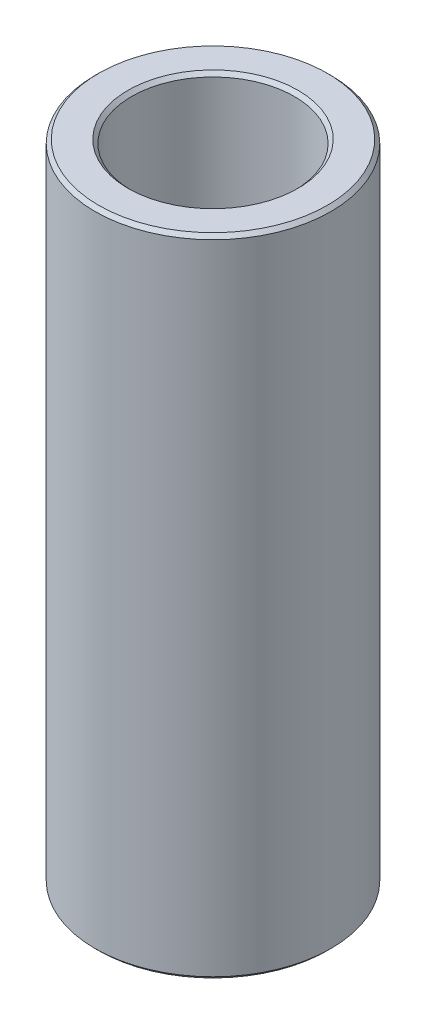
ISO-10303-21;
HEADER;
FILE_DESCRIPTION(('STEP AP214'),'2;1');
FILE_NAME('part.step','',(''),(''),'','','');
FILE_SCHEMA(('AUTOMOTIVE_DESIGN { 1 0 10303 214 1 1 1 1 }'));
ENDSEC;
DATA;
#1=APPLICATION_CONTEXT('core data for automotive mechanical design processes');
#2=APPLICATION_PROTOCOL_DEFINITION('international standard','automotive_design',2000,#1);
#3=PRODUCT_CONTEXT('',#1,'mechanical');
#4=PRODUCT('Part','Part','',(#3));
#5=PRODUCT_RELATED_PRODUCT_CATEGORY('part','',(#4));
#6=PRODUCT_DEFINITION_FORMATION('','',#4);
#7=PRODUCT_DEFINITION_CONTEXT('part definition',#1,'design');
#8=PRODUCT_DEFINITION('design','',#6,#7);
#9=PRODUCT_DEFINITION_SHAPE('','',#8);
#10=(LENGTH_UNIT() NAMED_UNIT(*) SI_UNIT(.MILLI.,.METRE.));
#11=(NAMED_UNIT(*) PLANE_ANGLE_UNIT() SI_UNIT($,.RADIAN.));
#12=(NAMED_UNIT(*) SI_UNIT($,.STERADIAN.) SOLID_ANGLE_UNIT());
#13=UNCERTAINTY_MEASURE_WITH_UNIT(LENGTH_MEASURE(1.E-05),#10,'distance_accuracy_value','');
#14=(GEOMETRIC_REPRESENTATION_CONTEXT(3) GLOBAL_UNCERTAINTY_ASSIGNED_CONTEXT((#13)) GLOBAL_UNIT_ASSIGNED_CONTEXT((#10,
#11,#12)) REPRESENTATION_CONTEXT('',''));
#15=CARTESIAN_POINT('',(0.,0.,0.));
#16=DIRECTION('',(0.,0.,1.));
#17=DIRECTION('',(1.,0.,0.));
#18=AXIS2_PLACEMENT_3D('',#15,#16,#17);
#19=CARTESIAN_POINT('',(0.,300.995779483035,0.));
#20=DIRECTION('',(0.,-1.,0.));
#21=DIRECTION('',(0.,0.,-1.));
#22=AXIS2_PLACEMENT_3D('',#19,#20,#21);
#23=CYLINDRICAL_SURFACE('',#22,55.);
#24=CARTESIAN_POINT('',(0.,1.67099441765101,0.));
#25=DIRECTION('',(0.,1.,0.));
#26=DIRECTION('',(0.,0.,1.));
#27=AXIS2_PLACEMENT_3D('',#24,#25,#26);
#28=CIRCLE('',#27,55.);
#29=CARTESIAN_POINT('',(0.,1.67099441765101,55.));
#30=VERTEX_POINT('',#29);
#31=EDGE_CURVE('E10',#30,#30,#28,.T.);
#32=ORIENTED_EDGE('',*,*,#31,.T.);
#33=EDGE_LOOP('',(#32));
#34=FACE_BOUND('',#33,.T.);
#35=CARTESIAN_POINT('',(0.,299.324785065384,0.));
#36=DIRECTION('',(0.,1.,0.));
#37=DIRECTION('',(0.,0.,1.));
#38=AXIS2_PLACEMENT_3D('',#35,#36,#37);
#39=CIRCLE('',#38,55.);
#40=CARTESIAN_POINT('',(0.,299.324785065384,55.));
#41=VERTEX_POINT('',#40);
#42=EDGE_CURVE('E50',#41,#41,#39,.F.);
#43=ORIENTED_EDGE('',*,*,#42,.T.);
#44=EDGE_LOOP('',(#43));
#45=FACE_BOUND('',#44,.T.);
#46=ADVANCED_FACE('F39',(#34,#45),#23,.T.);
#47=CARTESIAN_POINT('',(0.,300.995779483035,0.));
#48=DIRECTION('',(0.,1.,0.));
#49=DIRECTION('',(0.,0.,1.));
#50=AXIS2_PLACEMENT_3D('',#47,#48,#49);
#51=PLANE('',#50);
#52=CARTESIAN_POINT('',(0.,300.995779483035,0.));
#53=DIRECTION('',(0.,1.,0.));
#54=DIRECTION('',(0.,0.,1.));
#55=AXIS2_PLACEMENT_3D('',#52,#53,#54);
#56=CIRCLE('',#55,39.6455620120512);
#57=CARTESIAN_POINT('',(0.,300.995779483035,39.6455620120512));
#58=VERTEX_POINT('',#57);
#59=EDGE_CURVE('E58',#58,#58,#56,.F.);
#60=ORIENTED_EDGE('',*,*,#59,.T.);
#61=EDGE_LOOP('',(#60));
#62=FACE_BOUND('',#61,.T.);
#63=CARTESIAN_POINT('',(0.,300.995779483035,0.));
#64=DIRECTION('',(0.,1.,0.));
#65=DIRECTION('',(0.,0.,1.));
#66=AXIS2_PLACEMENT_3D('',#63,#64,#65);
#67=CIRCLE('',#66,53.3290055823489);
#68=CARTESIAN_POINT('',(0.,300.995779483035,53.3290055823489));
#69=VERTEX_POINT('',#68);
#70=EDGE_CURVE('E61',#69,#69,#67,.T.);
#71=ORIENTED_EDGE('',*,*,#70,.T.);
#72=EDGE_LOOP('',(#71));
#73=FACE_BOUND('',#72,.T.);
#74=ADVANCED_FACE('F88',(#62,#73),#51,.T.);
#75=CARTESIAN_POINT('',(0.,0.,0.));
#76=DIRECTION('',(0.,1.,0.));
#77=DIRECTION('',(0.,0.,1.));
#78=AXIS2_PLACEMENT_3D('',#75,#76,#77);
#79=PLANE('',#78);
#80=CARTESIAN_POINT('',(0.,0.,0.));
#81=DIRECTION('',(0.,1.,0.));
#82=DIRECTION('',(0.,0.,1.));
#83=AXIS2_PLACEMENT_3D('',#80,#81,#82);
#84=CIRCLE('',#83,39.6455620120512);
#85=CARTESIAN_POINT('',(0.,0.,39.6455620120512));
#86=VERTEX_POINT('',#85);
#87=EDGE_CURVE('E51',#86,#86,#84,.T.);
#88=ORIENTED_EDGE('',*,*,#87,.T.);
#89=EDGE_LOOP('',(#88));
#90=FACE_BOUND('',#89,.T.);
#91=CARTESIAN_POINT('',(0.,0.,0.));
#92=DIRECTION('',(0.,1.,0.));
#93=DIRECTION('',(0.,0.,1.));
#94=AXIS2_PLACEMENT_3D('',#91,#92,#93);
#95=CIRCLE('',#94,53.329005582349);
#96=CARTESIAN_POINT('',(0.,0.,53.329005582349));
#97=VERTEX_POINT('',#96);
#98=EDGE_CURVE('E54',#97,#97,#95,.F.);
#99=ORIENTED_EDGE('',*,*,#98,.T.);
#100=EDGE_LOOP('',(#99));
#101=FACE_BOUND('',#100,.T.);
#102=ADVANCED_FACE('F83',(#90,#101),#79,.F.);
#103=CARTESIAN_POINT('',(0.,300.995779483035,0.));
#104=DIRECTION('',(0.,-1.,0.));
#105=DIRECTION('',(0.,0.,-1.));
#106=AXIS2_PLACEMENT_3D('',#103,#104,#105);
#107=CYLINDRICAL_SURFACE('',#106,37.9745675944001);
#108=CARTESIAN_POINT('',(0.,299.324785065384,0.));
#109=DIRECTION('',(0.,1.,0.));
#110=DIRECTION('',(0.,0.,1.));
#111=AXIS2_PLACEMENT_3D('',#108,#109,#110);
#112=CIRCLE('',#111,37.9745675944001);
#113=CARTESIAN_POINT('',(0.,299.324785065384,37.9745675944001));
#114=VERTEX_POINT('',#113);
#115=EDGE_CURVE('E67',#114,#114,#112,.T.);
#116=ORIENTED_EDGE('',*,*,#115,.T.);
#117=EDGE_LOOP('',(#116));
#118=FACE_BOUND('',#117,.T.);
#119=CARTESIAN_POINT('',(0.,1.67099441765112,0.));
#120=DIRECTION('',(0.,1.,0.));
#121=DIRECTION('',(0.,0.,1.));
#122=AXIS2_PLACEMENT_3D('',#119,#120,#121);
#123=CIRCLE('',#122,37.9745675944001);
#124=CARTESIAN_POINT('',(0.,1.67099441765112,37.9745675944001));
#125=VERTEX_POINT('',#124);
#126=EDGE_CURVE('E69',#125,#125,#123,.F.);
#127=ORIENTED_EDGE('',*,*,#126,.T.);
#128=EDGE_LOOP('',(#127));
#129=FACE_BOUND('',#128,.T.);
#130=ADVANCED_FACE('F71',(#118,#129),#107,.F.);
#131=CARTESIAN_POINT('',(0.,299.324785065384,0.));
#132=DIRECTION('',(0.,1.,0.));
#133=DIRECTION('',(0.,0.,1.));
#134=AXIS2_PLACEMENT_3D('',#131,#132,#133);
#135=CONICAL_SURFACE('',#134,37.9745675944001,0.785398163397455);
#136=ORIENTED_EDGE('',*,*,#59,.F.);
#137=EDGE_LOOP('',(#136));
#138=FACE_BOUND('',#137,.T.);
#139=ORIENTED_EDGE('',*,*,#115,.F.);
#140=EDGE_LOOP('',(#139));
#141=FACE_BOUND('',#140,.T.);
#142=ADVANCED_FACE('F77',(#138,#141),#135,.F.);
#143=CARTESIAN_POINT('',(0.,0.,0.));
#144=DIRECTION('',(0.,-1.,0.));
#145=DIRECTION('',(0.,0.,-1.));
#146=AXIS2_PLACEMENT_3D('',#143,#144,#145);
#147=CONICAL_SURFACE('',#146,39.6455620120512,0.785398163397438);
#148=ORIENTED_EDGE('',*,*,#126,.F.);
#149=EDGE_LOOP('',(#148));
#150=FACE_BOUND('',#149,.T.);
#151=ORIENTED_EDGE('',*,*,#87,.F.);
#152=EDGE_LOOP('',(#151));
#153=FACE_BOUND('',#152,.T.);
#154=ADVANCED_FACE('F73',(#150,#153),#147,.F.);
#155=CARTESIAN_POINT('',(0.,1.67099441765101,0.));
#156=DIRECTION('',(0.,1.,0.));
#157=DIRECTION('',(0.,0.,1.));
#158=AXIS2_PLACEMENT_3D('',#155,#156,#157);
#159=CONICAL_SURFACE('',#158,55.,0.785398163397459);
#160=ORIENTED_EDGE('',*,*,#98,.F.);
#161=EDGE_LOOP('',(#160));
#162=FACE_BOUND('',#161,.T.);
#163=ORIENTED_EDGE('',*,*,#31,.F.);
#164=EDGE_LOOP('',(#163));
#165=FACE_BOUND('',#164,.T.);
#166=ADVANCED_FACE('F76',(#162,#165),#159,.T.);
#167=CARTESIAN_POINT('',(0.,300.995779483035,0.));
#168=DIRECTION('',(0.,-1.,0.));
#169=DIRECTION('',(0.,0.,-1.));
#170=AXIS2_PLACEMENT_3D('',#167,#168,#169);
#171=CONICAL_SURFACE('',#170,53.3290055823489,0.78539816339744);
#172=ORIENTED_EDGE('',*,*,#42,.F.);
#173=EDGE_LOOP('',(#172));
#174=FACE_BOUND('',#173,.T.);
#175=ORIENTED_EDGE('',*,*,#70,.F.);
#176=EDGE_LOOP('',(#175));
#177=FACE_BOUND('',#176,.T.);
#178=ADVANCED_FACE('F45',(#174,#177),#171,.T.);
#179=CLOSED_SHELL('',(#46,#74,#102,#130,#142,#154,#166,#178));
#180=MANIFOLD_SOLID_BREP('B2',#179);
#181=ADVANCED_BREP_SHAPE_REPRESENTATION('',(#18,#180),#14);
#182=SHAPE_DEFINITION_REPRESENTATION(#9,#181);
ENDSEC;
END-ISO-10303-21;
